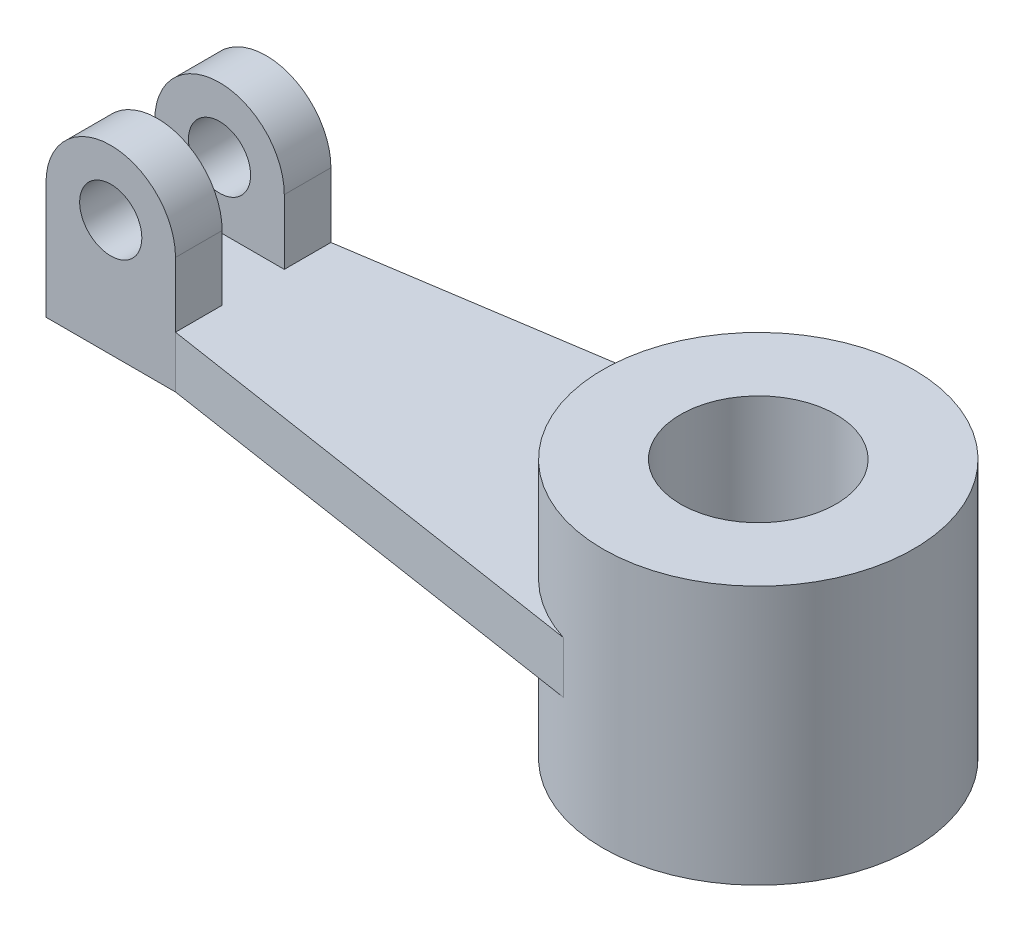
ISO-10303-21;
HEADER;
FILE_DESCRIPTION(('STEP AP214'),'2;1');
FILE_NAME('part.step','',(''),(''),'','','');
FILE_SCHEMA(('AUTOMOTIVE_DESIGN { 1 0 10303 214 1 1 1 1 }'));
ENDSEC;
DATA;
#1=APPLICATION_CONTEXT('core data for automotive mechanical design processes');
#2=APPLICATION_PROTOCOL_DEFINITION('international standard','automotive_design',2000,#1);
#3=PRODUCT_CONTEXT('',#1,'mechanical');
#4=PRODUCT('Part','Part','',(#3));
#5=PRODUCT_RELATED_PRODUCT_CATEGORY('part','',(#4));
#6=PRODUCT_DEFINITION_FORMATION('','',#4);
#7=PRODUCT_DEFINITION_CONTEXT('part definition',#1,'design');
#8=PRODUCT_DEFINITION('design','',#6,#7);
#9=PRODUCT_DEFINITION_SHAPE('','',#8);
#10=(LENGTH_UNIT() NAMED_UNIT(*) SI_UNIT(.MILLI.,.METRE.));
#11=(NAMED_UNIT(*) PLANE_ANGLE_UNIT() SI_UNIT($,.RADIAN.));
#12=(NAMED_UNIT(*) SI_UNIT($,.STERADIAN.) SOLID_ANGLE_UNIT());
#13=UNCERTAINTY_MEASURE_WITH_UNIT(LENGTH_MEASURE(1.E-05),#10,'distance_accuracy_value','');
#14=(GEOMETRIC_REPRESENTATION_CONTEXT(3) GLOBAL_UNCERTAINTY_ASSIGNED_CONTEXT((#13)) GLOBAL_UNIT_ASSIGNED_CONTEXT((#10,
#11,#12)) REPRESENTATION_CONTEXT('',''));
#15=CARTESIAN_POINT('',(0.,0.,0.));
#16=DIRECTION('',(0.,0.,1.));
#17=DIRECTION('',(1.,0.,0.));
#18=AXIS2_PLACEMENT_3D('',#15,#16,#17);
#19=CARTESIAN_POINT('',(0.,25.,0.));
#20=DIRECTION('',(0.,1.,0.));
#21=DIRECTION('',(0.,0.,1.));
#22=AXIS2_PLACEMENT_3D('',#19,#20,#21);
#23=PLANE('',#22);
#24=CARTESIAN_POINT('',(0.,25.,0.));
#25=DIRECTION('',(0.,1.,0.));
#26=DIRECTION('',(0.,0.,1.));
#27=AXIS2_PLACEMENT_3D('',#24,#25,#26);
#28=CIRCLE('',#27,30.);
#29=CARTESIAN_POINT('',(0.,25.,30.));
#30=VERTEX_POINT('',#29);
#31=EDGE_CURVE('E11',#30,#30,#28,.T.);
#32=ORIENTED_EDGE('',*,*,#31,.T.);
#33=EDGE_LOOP('',(#32));
#34=FACE_BOUND('',#33,.T.);
#35=CARTESIAN_POINT('',(0.,25.,0.));
#36=DIRECTION('',(0.,1.,0.));
#37=DIRECTION('',(0.,0.,1.));
#38=AXIS2_PLACEMENT_3D('',#35,#36,#37);
#39=CIRCLE('',#38,15.);
#40=CARTESIAN_POINT('',(0.,25.,15.));
#41=VERTEX_POINT('',#40);
#42=EDGE_CURVE('E213',#41,#41,#39,.T.);
#43=ORIENTED_EDGE('',*,*,#42,.F.);
#44=EDGE_LOOP('',(#43));
#45=FACE_BOUND('',#44,.T.);
#46=ADVANCED_FACE('F35',(#34,#45),#23,.T.);
#47=CARTESIAN_POINT('',(0.,-25.,0.));
#48=DIRECTION('',(0.,1.,0.));
#49=DIRECTION('',(0.,0.,1.));
#50=AXIS2_PLACEMENT_3D('',#47,#48,#49);
#51=PLANE('',#50);
#52=CARTESIAN_POINT('',(0.,-25.,0.));
#53=DIRECTION('',(0.,1.,0.));
#54=DIRECTION('',(0.,0.,1.));
#55=AXIS2_PLACEMENT_3D('',#52,#53,#54);
#56=CIRCLE('',#55,30.);
#57=CARTESIAN_POINT('',(0.,-25.,30.));
#58=VERTEX_POINT('',#57);
#59=EDGE_CURVE('E39',#58,#58,#56,.T.);
#60=ORIENTED_EDGE('',*,*,#59,.F.);
#61=EDGE_LOOP('',(#60));
#62=FACE_BOUND('',#61,.T.);
#63=CARTESIAN_POINT('',(0.,-25.,0.));
#64=DIRECTION('',(0.,1.,0.));
#65=DIRECTION('',(0.,0.,1.));
#66=AXIS2_PLACEMENT_3D('',#63,#64,#65);
#67=CIRCLE('',#66,15.);
#68=CARTESIAN_POINT('',(0.,-25.,15.));
#69=VERTEX_POINT('',#68);
#70=EDGE_CURVE('E212',#69,#69,#67,.T.);
#71=ORIENTED_EDGE('',*,*,#70,.T.);
#72=EDGE_LOOP('',(#71));
#73=FACE_BOUND('',#72,.T.);
#74=ADVANCED_FACE('F219',(#62,#73),#51,.F.);
#75=CARTESIAN_POINT('',(0.,25.,0.));
#76=DIRECTION('',(0.,-1.,0.));
#77=DIRECTION('',(0.,0.,-1.));
#78=AXIS2_PLACEMENT_3D('',#75,#76,#77);
#79=CYLINDRICAL_SURFACE('',#78,30.);
#80=DIRECTION('',(0.,-1.,0.));
#81=VECTOR('',#80,1.);
#82=CARTESIAN_POINT('',(-9.01734104046243,5.,-28.6127167630058));
#83=LINE('',#82,#81);
#84=CARTESIAN_POINT('',(-9.01734104046244,5.,-28.6127167630058));
#85=VERTEX_POINT('',#84);
#86=CARTESIAN_POINT('',(-9.01734104046243,-5.,-28.6127167630058));
#87=VERTEX_POINT('',#86);
#88=EDGE_CURVE('E209',#85,#87,#83,.T.);
#89=ORIENTED_EDGE('',*,*,#88,.F.);
#90=CARTESIAN_POINT('',(0.,5.,0.));
#91=DIRECTION('',(0.,1.,0.));
#92=DIRECTION('',(0.,0.,1.));
#93=AXIS2_PLACEMENT_3D('',#90,#91,#92);
#94=CIRCLE('',#93,30.);
#95=CARTESIAN_POINT('',(-9.01734104046244,5.,28.6127167630058));
#96=VERTEX_POINT('',#95);
#97=EDGE_CURVE('E173',#85,#96,#94,.T.);
#98=ORIENTED_EDGE('',*,*,#97,.T.);
#99=DIRECTION('',(0.,-1.,0.));
#100=VECTOR('',#99,1.);
#101=CARTESIAN_POINT('',(-9.01734104046243,5.,28.6127167630058));
#102=LINE('',#101,#100);
#103=CARTESIAN_POINT('',(-9.01734104046243,-5.,28.6127167630058));
#104=VERTEX_POINT('',#103);
#105=EDGE_CURVE('E183',#96,#104,#102,.T.);
#106=ORIENTED_EDGE('',*,*,#105,.T.);
#107=CARTESIAN_POINT('',(0.,-5.,0.));
#108=DIRECTION('',(0.,1.,0.));
#109=DIRECTION('',(0.,0.,1.));
#110=AXIS2_PLACEMENT_3D('',#107,#108,#109);
#111=CIRCLE('',#110,30.);
#112=EDGE_CURVE('E172',#87,#104,#111,.T.);
#113=ORIENTED_EDGE('',*,*,#112,.F.);
#114=EDGE_LOOP('',(#89,#98,#106,#113));
#115=FACE_BOUND('',#114,.T.);
#116=ORIENTED_EDGE('',*,*,#31,.F.);
#117=EDGE_LOOP('',(#116));
#118=FACE_BOUND('',#117,.T.);
#119=ORIENTED_EDGE('',*,*,#59,.T.);
#120=EDGE_LOOP('',(#119));
#121=FACE_BOUND('',#120,.T.);
#122=ADVANCED_FACE('F37',(#115,#118,#121),#79,.T.);
#123=CARTESIAN_POINT('',(0.,25.,0.));
#124=DIRECTION('',(0.,-1.,0.));
#125=DIRECTION('',(0.,0.,-1.));
#126=AXIS2_PLACEMENT_3D('',#123,#124,#125);
#127=CYLINDRICAL_SURFACE('',#126,15.);
#128=ORIENTED_EDGE('',*,*,#42,.T.);
#129=EDGE_LOOP('',(#128));
#130=FACE_BOUND('',#129,.T.);
#131=ORIENTED_EDGE('',*,*,#70,.F.);
#132=EDGE_LOOP('',(#131));
#133=FACE_BOUND('',#132,.T.);
#134=ADVANCED_FACE('F221',(#130,#133),#127,.F.);
#135=CARTESIAN_POINT('',(-4.50867052023121,5.,-29.3063583815029));
#136=DIRECTION('',(-0.152057184253941,0.,-0.988371697650617));
#137=DIRECTION('',(-0.988371697650617,0.,0.152057184253941));
#138=AXIS2_PLACEMENT_3D('',#135,#136,#137);
#139=PLANE('',#138);
#140=DIRECTION('',(0.988371697650617,0.,-0.152057184253941));
#141=VECTOR('',#140,1.);
#142=CARTESIAN_POINT('',(-4.50867052023121,-5.,-29.3063583815029));
#143=LINE('',#142,#141);
#144=CARTESIAN_POINT('',(-97.5,-5.,-15.));
#145=VERTEX_POINT('',#144);
#146=EDGE_CURVE('E186',#145,#87,#143,.T.);
#147=ORIENTED_EDGE('',*,*,#146,.F.);
#148=DIRECTION('',(0.,-1.,0.));
#149=VECTOR('',#148,1.);
#150=CARTESIAN_POINT('',(-97.5,5.,-15.));
#151=LINE('',#150,#149);
#152=CARTESIAN_POINT('',(-97.5,5.,-15.));
#153=VERTEX_POINT('',#152);
#154=EDGE_CURVE('E207',#153,#145,#151,.T.);
#155=ORIENTED_EDGE('',*,*,#154,.F.);
#156=DIRECTION('',(0.988371697650617,0.,-0.152057184253941));
#157=VECTOR('',#156,1.);
#158=CARTESIAN_POINT('',(-4.50867052023121,5.,-29.3063583815029));
#159=LINE('',#158,#157);
#160=EDGE_CURVE('E175',#153,#85,#159,.T.);
#161=ORIENTED_EDGE('',*,*,#160,.T.);
#162=ORIENTED_EDGE('',*,*,#88,.T.);
#163=EDGE_LOOP('',(#147,#155,#161,#162));
#164=FACE_BOUND('',#163,.T.);
#165=ADVANCED_FACE('F223',(#164),#139,.T.);
#166=CARTESIAN_POINT('',(0.,5.,-15.));
#167=DIRECTION('',(0.,0.,-1.));
#168=DIRECTION('',(-1.,0.,0.));
#169=AXIS2_PLACEMENT_3D('',#166,#167,#168);
#170=PLANE('',#169);
#171=DIRECTION('',(1.,0.,0.));
#172=VECTOR('',#171,1.);
#173=CARTESIAN_POINT('',(0.,-5.,-15.));
#174=LINE('',#173,#172);
#175=CARTESIAN_POINT('',(-122.5,-5.,-15.));
#176=VERTEX_POINT('',#175);
#177=EDGE_CURVE('E189',#176,#145,#174,.T.);
#178=ORIENTED_EDGE('',*,*,#177,.F.);
#179=DIRECTION('',(0.,-1.,0.));
#180=VECTOR('',#179,1.);
#181=CARTESIAN_POINT('',(-122.5,5.,-15.));
#182=LINE('',#181,#180);
#183=CARTESIAN_POINT('',(-122.5,17.5,-15.));
#184=VERTEX_POINT('',#183);
#185=EDGE_CURVE('E205',#184,#176,#182,.T.);
#186=ORIENTED_EDGE('',*,*,#185,.F.);
#187=CARTESIAN_POINT('',(-110.,17.5,-15.));
#188=DIRECTION('',(0.,0.,-1.));
#189=DIRECTION('',(1.,0.,0.));
#190=AXIS2_PLACEMENT_3D('',#187,#188,#189);
#191=CIRCLE('',#190,12.5);
#192=CARTESIAN_POINT('',(-97.5,17.4999999999999,-15.));
#193=VERTEX_POINT('',#192);
#194=EDGE_CURVE('E132',#184,#193,#191,.T.);
#195=ORIENTED_EDGE('',*,*,#194,.T.);
#196=DIRECTION('',(0.,-1.,0.));
#197=VECTOR('',#196,1.);
#198=CARTESIAN_POINT('',(-97.5,5.,-15.));
#199=LINE('',#198,#197);
#200=EDGE_CURVE('E142',#193,#153,#199,.T.);
#201=ORIENTED_EDGE('',*,*,#200,.T.);
#202=ORIENTED_EDGE('',*,*,#154,.T.);
#203=EDGE_LOOP('',(#178,#186,#195,#201,#202));
#204=FACE_BOUND('',#203,.T.);
#205=CARTESIAN_POINT('',(-110.,17.5,-15.));
#206=DIRECTION('',(0.,0.,-1.));
#207=DIRECTION('',(-1.,0.,0.));
#208=AXIS2_PLACEMENT_3D('',#205,#206,#207);
#209=CIRCLE('',#208,6.);
#210=CARTESIAN_POINT('',(-116.,17.5,-15.));
#211=VERTEX_POINT('',#210);
#212=EDGE_CURVE('E414',#211,#211,#209,.T.);
#213=ORIENTED_EDGE('',*,*,#212,.F.);
#214=EDGE_LOOP('',(#213));
#215=FACE_BOUND('',#214,.T.);
#216=ADVANCED_FACE('F230',(#204,#215),#170,.T.);
#217=CARTESIAN_POINT('',(-122.5,5.,0.));
#218=DIRECTION('',(1.,0.,0.));
#219=DIRECTION('',(0.,0.,-1.));
#220=AXIS2_PLACEMENT_3D('',#217,#218,#219);
#221=PLANE('',#220);
#222=DIRECTION('',(0.,0.,1.));
#223=VECTOR('',#222,1.);
#224=CARTESIAN_POINT('',(-122.5,5.,0.));
#225=LINE('',#224,#223);
#226=CARTESIAN_POINT('',(-122.5,5.,-6.));
#227=VERTEX_POINT('',#226);
#228=CARTESIAN_POINT('',(-122.5,5.,6.));
#229=VERTEX_POINT('',#228);
#230=EDGE_CURVE('E55',#227,#229,#225,.T.);
#231=ORIENTED_EDGE('',*,*,#230,.F.);
#232=DIRECTION('',(0.,1.,0.));
#233=VECTOR('',#232,1.);
#234=CARTESIAN_POINT('',(-122.5,-5.,-6.));
#235=LINE('',#234,#233);
#236=CARTESIAN_POINT('',(-122.5,17.5,-6.));
#237=VERTEX_POINT('',#236);
#238=EDGE_CURVE('E117',#227,#237,#235,.T.);
#239=ORIENTED_EDGE('',*,*,#238,.T.);
#240=DIRECTION('',(0.,0.,-1.));
#241=VECTOR('',#240,1.);
#242=CARTESIAN_POINT('',(-122.5,17.5,-6.));
#243=LINE('',#242,#241);
#244=EDGE_CURVE('E120',#237,#184,#243,.T.);
#245=ORIENTED_EDGE('',*,*,#244,.T.);
#246=ORIENTED_EDGE('',*,*,#185,.T.);
#247=DIRECTION('',(0.,0.,1.));
#248=VECTOR('',#247,1.);
#249=CARTESIAN_POINT('',(-122.5,-5.,0.));
#250=LINE('',#249,#248);
#251=CARTESIAN_POINT('',(-122.5,-5.,15.));
#252=VERTEX_POINT('',#251);
#253=EDGE_CURVE('E192',#176,#252,#250,.T.);
#254=ORIENTED_EDGE('',*,*,#253,.T.);
#255=DIRECTION('',(0.,-1.,0.));
#256=VECTOR('',#255,1.);
#257=CARTESIAN_POINT('',(-122.5,5.,15.));
#258=LINE('',#257,#256);
#259=CARTESIAN_POINT('',(-122.5,17.5,15.));
#260=VERTEX_POINT('',#259);
#261=EDGE_CURVE('E202',#260,#252,#258,.T.);
#262=ORIENTED_EDGE('',*,*,#261,.F.);
#263=DIRECTION('',(0.,0.,1.));
#264=VECTOR('',#263,1.);
#265=CARTESIAN_POINT('',(-122.5,17.5,6.));
#266=LINE('',#265,#264);
#267=CARTESIAN_POINT('',(-122.5,17.5,6.));
#268=VERTEX_POINT('',#267);
#269=EDGE_CURVE('E164',#268,#260,#266,.T.);
#270=ORIENTED_EDGE('',*,*,#269,.F.);
#271=DIRECTION('',(0.,-1.,0.));
#272=VECTOR('',#271,1.);
#273=CARTESIAN_POINT('',(-122.5,5.,6.));
#274=LINE('',#273,#272);
#275=EDGE_CURVE('E152',#268,#229,#274,.T.);
#276=ORIENTED_EDGE('',*,*,#275,.T.);
#277=EDGE_LOOP('',(#231,#239,#245,#246,#254,#262,#270,#276));
#278=FACE_BOUND('',#277,.T.);
#279=ADVANCED_FACE('F119',(#278),#221,.F.);
#280=CARTESIAN_POINT('',(0.,5.,15.));
#281=DIRECTION('',(0.,0.,-1.));
#282=DIRECTION('',(-1.,0.,0.));
#283=AXIS2_PLACEMENT_3D('',#280,#281,#282);
#284=PLANE('',#283);
#285=CARTESIAN_POINT('',(-110.,17.5,15.));
#286=DIRECTION('',(0.,0.,1.));
#287=DIRECTION('',(1.,0.,0.));
#288=AXIS2_PLACEMENT_3D('',#285,#286,#287);
#289=CIRCLE('',#288,6.);
#290=CARTESIAN_POINT('',(-104.,17.5,15.));
#291=VERTEX_POINT('',#290);
#292=EDGE_CURVE('E412',#291,#291,#289,.T.);
#293=ORIENTED_EDGE('',*,*,#292,.F.);
#294=EDGE_LOOP('',(#293));
#295=FACE_BOUND('',#294,.T.);
#296=DIRECTION('',(1.,0.,0.));
#297=VECTOR('',#296,1.);
#298=CARTESIAN_POINT('',(0.,-5.,15.));
#299=LINE('',#298,#297);
#300=CARTESIAN_POINT('',(-97.5,-5.,15.));
#301=VERTEX_POINT('',#300);
#302=EDGE_CURVE('E194',#252,#301,#299,.T.);
#303=ORIENTED_EDGE('',*,*,#302,.T.);
#304=DIRECTION('',(0.,-1.,0.));
#305=VECTOR('',#304,1.);
#306=CARTESIAN_POINT('',(-97.5,5.,15.));
#307=LINE('',#306,#305);
#308=CARTESIAN_POINT('',(-97.5,5.,15.));
#309=VERTEX_POINT('',#308);
#310=EDGE_CURVE('E199',#309,#301,#307,.T.);
#311=ORIENTED_EDGE('',*,*,#310,.F.);
#312=DIRECTION('',(0.,1.,0.));
#313=VECTOR('',#312,1.);
#314=CARTESIAN_POINT('',(-97.5,5.,15.));
#315=LINE('',#314,#313);
#316=CARTESIAN_POINT('',(-97.5,17.5,15.));
#317=VERTEX_POINT('',#316);
#318=EDGE_CURVE('E151',#309,#317,#315,.T.);
#319=ORIENTED_EDGE('',*,*,#318,.T.);
#320=CARTESIAN_POINT('',(-110.,17.5,15.));
#321=DIRECTION('',(0.,0.,1.));
#322=DIRECTION('',(-1.,0.,0.));
#323=AXIS2_PLACEMENT_3D('',#320,#321,#322);
#324=CIRCLE('',#323,12.5);
#325=EDGE_CURVE('E155',#317,#260,#324,.T.);
#326=ORIENTED_EDGE('',*,*,#325,.T.);
#327=ORIENTED_EDGE('',*,*,#261,.T.);
#328=EDGE_LOOP('',(#303,#311,#319,#326,#327));
#329=FACE_BOUND('',#328,.T.);
#330=ADVANCED_FACE('F267',(#295,#329),#284,.F.);
#331=CARTESIAN_POINT('',(-4.50867052023121,5.,29.3063583815029));
#332=DIRECTION('',(0.152057184253941,0.,-0.988371697650617));
#333=DIRECTION('',(-0.988371697650617,0.,-0.152057184253941));
#334=AXIS2_PLACEMENT_3D('',#331,#332,#333);
#335=PLANE('',#334);
#336=DIRECTION('',(0.988371697650617,0.,0.152057184253941));
#337=VECTOR('',#336,1.);
#338=CARTESIAN_POINT('',(-4.50867052023121,-5.,29.3063583815029));
#339=LINE('',#338,#337);
#340=EDGE_CURVE('E176',#301,#104,#339,.T.);
#341=ORIENTED_EDGE('',*,*,#340,.T.);
#342=ORIENTED_EDGE('',*,*,#105,.F.);
#343=DIRECTION('',(0.988371697650617,0.,0.152057184253941));
#344=VECTOR('',#343,1.);
#345=CARTESIAN_POINT('',(-4.50867052023121,5.,29.3063583815029));
#346=LINE('',#345,#344);
#347=EDGE_CURVE('E180',#309,#96,#346,.T.);
#348=ORIENTED_EDGE('',*,*,#347,.F.);
#349=ORIENTED_EDGE('',*,*,#310,.T.);
#350=EDGE_LOOP('',(#341,#342,#348,#349));
#351=FACE_BOUND('',#350,.T.);
#352=ADVANCED_FACE('F261',(#351),#335,.F.);
#353=CARTESIAN_POINT('',(0.,5.,0.));
#354=DIRECTION('',(0.,1.,0.));
#355=DIRECTION('',(0.,0.,1.));
#356=AXIS2_PLACEMENT_3D('',#353,#354,#355);
#357=PLANE('',#356);
#358=DIRECTION('',(0.,0.,-1.));
#359=VECTOR('',#358,1.);
#360=CARTESIAN_POINT('',(-97.5,5.,0.));
#361=LINE('',#360,#359);
#362=CARTESIAN_POINT('',(-97.5,5.,-6.));
#363=VERTEX_POINT('',#362);
#364=EDGE_CURVE('E148',#363,#153,#361,.T.);
#365=ORIENTED_EDGE('',*,*,#364,.F.);
#366=DIRECTION('',(1.,0.,0.));
#367=VECTOR('',#366,1.);
#368=CARTESIAN_POINT('',(0.,5.,-6.));
#369=LINE('',#368,#367);
#370=EDGE_CURVE('E145',#227,#363,#369,.T.);
#371=ORIENTED_EDGE('',*,*,#370,.F.);
#372=ORIENTED_EDGE('',*,*,#230,.T.);
#373=DIRECTION('',(-1.,0.,0.));
#374=VECTOR('',#373,1.);
#375=CARTESIAN_POINT('',(0.,5.,6.));
#376=LINE('',#375,#374);
#377=CARTESIAN_POINT('',(-97.5,5.,6.));
#378=VERTEX_POINT('',#377);
#379=EDGE_CURVE('E50',#378,#229,#376,.T.);
#380=ORIENTED_EDGE('',*,*,#379,.F.);
#381=DIRECTION('',(0.,0.,-1.));
#382=VECTOR('',#381,1.);
#383=CARTESIAN_POINT('',(-97.5,5.,0.));
#384=LINE('',#383,#382);
#385=EDGE_CURVE('E170',#309,#378,#384,.T.);
#386=ORIENTED_EDGE('',*,*,#385,.F.);
#387=ORIENTED_EDGE('',*,*,#347,.T.);
#388=ORIENTED_EDGE('',*,*,#97,.F.);
#389=ORIENTED_EDGE('',*,*,#160,.F.);
#390=EDGE_LOOP('',(#365,#371,#372,#380,#386,#387,#388,#389));
#391=FACE_BOUND('',#390,.T.);
#392=ADVANCED_FACE('F266',(#391),#357,.T.);
#393=CARTESIAN_POINT('',(0.,-5.,0.));
#394=DIRECTION('',(0.,1.,0.));
#395=DIRECTION('',(0.,0.,1.));
#396=AXIS2_PLACEMENT_3D('',#393,#394,#395);
#397=PLANE('',#396);
#398=ORIENTED_EDGE('',*,*,#177,.T.);
#399=ORIENTED_EDGE('',*,*,#146,.T.);
#400=ORIENTED_EDGE('',*,*,#112,.T.);
#401=ORIENTED_EDGE('',*,*,#340,.F.);
#402=ORIENTED_EDGE('',*,*,#302,.F.);
#403=ORIENTED_EDGE('',*,*,#253,.F.);
#404=EDGE_LOOP('',(#398,#399,#400,#401,#402,#403));
#405=FACE_BOUND('',#404,.T.);
#406=ADVANCED_FACE('F283',(#405),#397,.F.);
#407=CARTESIAN_POINT('',(-110.,17.5,6.));
#408=DIRECTION('',(0.,0.,1.));
#409=DIRECTION('',(1.,0.,0.));
#410=AXIS2_PLACEMENT_3D('',#407,#408,#409);
#411=CYLINDRICAL_SURFACE('',#410,12.5);
#412=ORIENTED_EDGE('',*,*,#325,.F.);
#413=DIRECTION('',(0.,0.,1.));
#414=VECTOR('',#413,1.);
#415=CARTESIAN_POINT('',(-97.5,17.5,6.));
#416=LINE('',#415,#414);
#417=CARTESIAN_POINT('',(-97.5,17.5,6.));
#418=VERTEX_POINT('',#417);
#419=EDGE_CURVE('E160',#418,#317,#416,.T.);
#420=ORIENTED_EDGE('',*,*,#419,.F.);
#421=CARTESIAN_POINT('',(-110.,17.5,6.));
#422=DIRECTION('',(0.,0.,1.));
#423=DIRECTION('',(-1.,0.,0.));
#424=AXIS2_PLACEMENT_3D('',#421,#422,#423);
#425=CIRCLE('',#424,12.5);
#426=EDGE_CURVE('E157',#418,#268,#425,.T.);
#427=ORIENTED_EDGE('',*,*,#426,.T.);
#428=ORIENTED_EDGE('',*,*,#269,.T.);
#429=EDGE_LOOP('',(#412,#420,#427,#428));
#430=FACE_BOUND('',#429,.T.);
#431=ADVANCED_FACE('F277',(#430),#411,.T.);
#432=CARTESIAN_POINT('',(-97.5,5.,6.));
#433=DIRECTION('',(1.,0.,0.));
#434=DIRECTION('',(0.,0.,-1.));
#435=AXIS2_PLACEMENT_3D('',#432,#433,#434);
#436=PLANE('',#435);
#437=ORIENTED_EDGE('',*,*,#318,.F.);
#438=ORIENTED_EDGE('',*,*,#385,.T.);
#439=DIRECTION('',(0.,1.,0.));
#440=VECTOR('',#439,1.);
#441=CARTESIAN_POINT('',(-97.5,-5.,6.));
#442=LINE('',#441,#440);
#443=EDGE_CURVE('E154',#378,#418,#442,.T.);
#444=ORIENTED_EDGE('',*,*,#443,.T.);
#445=ORIENTED_EDGE('',*,*,#419,.T.);
#446=EDGE_LOOP('',(#437,#438,#444,#445));
#447=FACE_BOUND('',#446,.T.);
#448=ADVANCED_FACE('F282',(#447),#436,.T.);
#449=CARTESIAN_POINT('',(-110.,17.5,6.));
#450=DIRECTION('',(0.,0.,-1.));
#451=DIRECTION('',(-1.,0.,0.));
#452=AXIS2_PLACEMENT_3D('',#449,#450,#451);
#453=PLANE('',#452);
#454=CARTESIAN_POINT('',(-110.,17.5,6.));
#455=DIRECTION('',(0.,0.,-1.));
#456=DIRECTION('',(-1.,0.,0.));
#457=AXIS2_PLACEMENT_3D('',#454,#455,#456);
#458=CIRCLE('',#457,6.);
#459=CARTESIAN_POINT('',(-116.,17.5,6.));
#460=VERTEX_POINT('',#459);
#461=EDGE_CURVE('E409',#460,#460,#458,.T.);
#462=ORIENTED_EDGE('',*,*,#461,.F.);
#463=EDGE_LOOP('',(#462));
#464=FACE_BOUND('',#463,.T.);
#465=ORIENTED_EDGE('',*,*,#443,.F.);
#466=ORIENTED_EDGE('',*,*,#379,.T.);
#467=ORIENTED_EDGE('',*,*,#275,.F.);
#468=ORIENTED_EDGE('',*,*,#426,.F.);
#469=EDGE_LOOP('',(#465,#466,#467,#468));
#470=FACE_BOUND('',#469,.T.);
#471=ADVANCED_FACE('F296',(#464,#470),#453,.T.);
#472=CARTESIAN_POINT('',(-97.5,5.,-6.));
#473=DIRECTION('',(1.,0.,0.));
#474=DIRECTION('',(0.,0.,-1.));
#475=AXIS2_PLACEMENT_3D('',#472,#473,#474);
#476=PLANE('',#475);
#477=DIRECTION('',(0.,-1.,0.));
#478=VECTOR('',#477,1.);
#479=CARTESIAN_POINT('',(-97.5,5.,-6.));
#480=LINE('',#479,#478);
#481=CARTESIAN_POINT('',(-97.5,17.4999999999999,-6.));
#482=VERTEX_POINT('',#481);
#483=EDGE_CURVE('E126',#482,#363,#480,.T.);
#484=ORIENTED_EDGE('',*,*,#483,.T.);
#485=ORIENTED_EDGE('',*,*,#364,.T.);
#486=ORIENTED_EDGE('',*,*,#200,.F.);
#487=DIRECTION('',(0.,0.,-1.));
#488=VECTOR('',#487,1.);
#489=CARTESIAN_POINT('',(-97.5,17.4999999999999,-6.));
#490=LINE('',#489,#488);
#491=EDGE_CURVE('E133',#482,#193,#490,.T.);
#492=ORIENTED_EDGE('',*,*,#491,.F.);
#493=EDGE_LOOP('',(#484,#485,#486,#492));
#494=FACE_BOUND('',#493,.T.);
#495=ADVANCED_FACE('F345',(#494),#476,.T.);
#496=CARTESIAN_POINT('',(-110.,17.5,-6.));
#497=DIRECTION('',(0.,0.,-1.));
#498=DIRECTION('',(-1.,0.,0.));
#499=AXIS2_PLACEMENT_3D('',#496,#497,#498);
#500=CYLINDRICAL_SURFACE('',#499,12.5);
#501=ORIENTED_EDGE('',*,*,#194,.F.);
#502=ORIENTED_EDGE('',*,*,#244,.F.);
#503=CARTESIAN_POINT('',(-110.,17.5,-6.));
#504=DIRECTION('',(0.,0.,-1.));
#505=DIRECTION('',(1.,0.,0.));
#506=AXIS2_PLACEMENT_3D('',#503,#504,#505);
#507=CIRCLE('',#506,12.5);
#508=EDGE_CURVE('E125',#237,#482,#507,.T.);
#509=ORIENTED_EDGE('',*,*,#508,.T.);
#510=ORIENTED_EDGE('',*,*,#491,.T.);
#511=EDGE_LOOP('',(#501,#502,#509,#510));
#512=FACE_BOUND('',#511,.T.);
#513=ADVANCED_FACE('F130',(#512),#500,.T.);
#514=CARTESIAN_POINT('',(-110.,17.5,-6.));
#515=DIRECTION('',(0.,0.,1.));
#516=DIRECTION('',(1.,0.,0.));
#517=AXIS2_PLACEMENT_3D('',#514,#515,#516);
#518=PLANE('',#517);
#519=CARTESIAN_POINT('',(-110.,17.5,-6.));
#520=DIRECTION('',(0.,0.,-1.));
#521=DIRECTION('',(-1.,0.,0.));
#522=AXIS2_PLACEMENT_3D('',#519,#520,#521);
#523=CIRCLE('',#522,6.);
#524=CARTESIAN_POINT('',(-116.,17.5,-6.));
#525=VERTEX_POINT('',#524);
#526=EDGE_CURVE('E143',#525,#525,#523,.T.);
#527=ORIENTED_EDGE('',*,*,#526,.T.);
#528=EDGE_LOOP('',(#527));
#529=FACE_BOUND('',#528,.T.);
#530=ORIENTED_EDGE('',*,*,#238,.F.);
#531=ORIENTED_EDGE('',*,*,#370,.T.);
#532=ORIENTED_EDGE('',*,*,#483,.F.);
#533=ORIENTED_EDGE('',*,*,#508,.F.);
#534=EDGE_LOOP('',(#530,#531,#532,#533));
#535=FACE_BOUND('',#534,.T.);
#536=ADVANCED_FACE('F135',(#529,#535),#518,.T.);
#537=CARTESIAN_POINT('',(-110.,17.5,-6.));
#538=DIRECTION('',(0.,0.,-1.));
#539=DIRECTION('',(-1.,0.,0.));
#540=AXIS2_PLACEMENT_3D('',#537,#538,#539);
#541=CYLINDRICAL_SURFACE('',#540,6.);
#542=ORIENTED_EDGE('',*,*,#526,.F.);
#543=EDGE_LOOP('',(#542));
#544=FACE_BOUND('',#543,.T.);
#545=ORIENTED_EDGE('',*,*,#212,.T.);
#546=EDGE_LOOP('',(#545));
#547=FACE_BOUND('',#546,.T.);
#548=ADVANCED_FACE('F367',(#544,#547),#541,.F.);
#549=CARTESIAN_POINT('',(-110.,17.5,-30.));
#550=DIRECTION('',(0.,0.,1.));
#551=DIRECTION('',(1.,0.,0.));
#552=AXIS2_PLACEMENT_3D('',#549,#550,#551);
#553=CYLINDRICAL_SURFACE('',#552,6.);
#554=ORIENTED_EDGE('',*,*,#461,.T.);
#555=EDGE_LOOP('',(#554));
#556=FACE_BOUND('',#555,.T.);
#557=ORIENTED_EDGE('',*,*,#292,.T.);
#558=EDGE_LOOP('',(#557));
#559=FACE_BOUND('',#558,.T.);
#560=ADVANCED_FACE('F377',(#556,#559),#553,.F.);
#561=CLOSED_SHELL('',(#46,#74,#122,#134,#165,#216,#279,#330,#352,#392,#406,#431,#448,#471,#495,
#513,#536,#548,#560));
#562=MANIFOLD_SOLID_BREP('B2',#561);
#563=ADVANCED_BREP_SHAPE_REPRESENTATION('',(#18,#562),#14);
#564=SHAPE_DEFINITION_REPRESENTATION(#9,#563);
ENDSEC;
END-ISO-10303-21;
